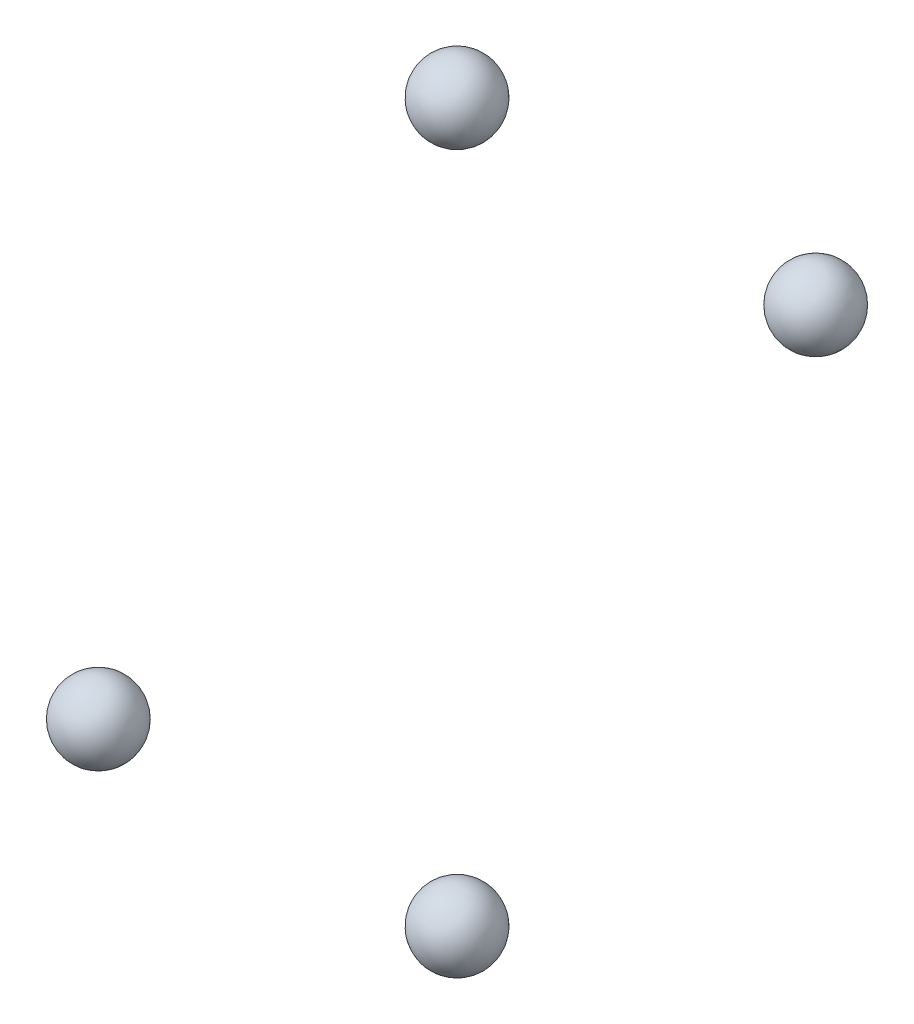
ISO-10303-21;
HEADER;
FILE_DESCRIPTION(('STEP AP214'),'2;1');
FILE_NAME('part.step','',(''),(''),'','','');
FILE_SCHEMA(('AUTOMOTIVE_DESIGN { 1 0 10303 214 1 1 1 1 }'));
ENDSEC;
DATA;
#1=APPLICATION_CONTEXT('core data for automotive mechanical design processes');
#2=APPLICATION_PROTOCOL_DEFINITION('international standard','automotive_design',2000,#1);
#3=PRODUCT_CONTEXT('',#1,'mechanical');
#4=PRODUCT('Part','Part','',(#3));
#5=PRODUCT_RELATED_PRODUCT_CATEGORY('part','',(#4));
#6=PRODUCT_DEFINITION_FORMATION('','',#4);
#7=PRODUCT_DEFINITION_CONTEXT('part definition',#1,'design');
#8=PRODUCT_DEFINITION('design','',#6,#7);
#9=PRODUCT_DEFINITION_SHAPE('','',#8);
#10=(LENGTH_UNIT() NAMED_UNIT(*) SI_UNIT(.MILLI.,.METRE.));
#11=(NAMED_UNIT(*) PLANE_ANGLE_UNIT() SI_UNIT($,.RADIAN.));
#12=(NAMED_UNIT(*) SI_UNIT($,.STERADIAN.) SOLID_ANGLE_UNIT());
#13=UNCERTAINTY_MEASURE_WITH_UNIT(LENGTH_MEASURE(1.E-05),#10,'distance_accuracy_value','');
#14=(GEOMETRIC_REPRESENTATION_CONTEXT(3) GLOBAL_UNCERTAINTY_ASSIGNED_CONTEXT((#13)) GLOBAL_UNIT_ASSIGNED_CONTEXT((#10,
#11,#12)) REPRESENTATION_CONTEXT('',''));
#15=CARTESIAN_POINT('',(0.,0.,0.));
#16=DIRECTION('',(0.,0.,1.));
#17=DIRECTION('',(1.,0.,0.));
#18=AXIS2_PLACEMENT_3D('',#15,#16,#17);
#19=CARTESIAN_POINT('',(0.,-20.5,0.));
#20=DIRECTION('',(0.,0.,-1.));
#21=DIRECTION('',(1.,0.,0.));
#22=AXIS2_PLACEMENT_3D('',#19,#20,#21);
#23=SPHERICAL_SURFACE('',#22,2.1);
#24=CARTESIAN_POINT('',(0.,-20.5,-2.1));
#25=VERTEX_POINT('',#24);
#26=VERTEX_LOOP('',#25);
#27=FACE_BOUND('',#26,.T.);
#28=ADVANCED_FACE('F12',(#27),#23,.T.);
#29=CLOSED_SHELL('',(#28));
#30=MANIFOLD_SOLID_BREP('B1',#29);
#31=CARTESIAN_POINT('',(0.,20.5,0.));
#32=DIRECTION('',(0.,0.,1.));
#33=DIRECTION('',(1.,0.,0.));
#34=AXIS2_PLACEMENT_3D('',#31,#32,#33);
#35=SPHERICAL_SURFACE('',#34,2.1);
#36=CARTESIAN_POINT('',(0.,20.5,2.1));
#37=VERTEX_POINT('',#36);
#38=VERTEX_LOOP('',#37);
#39=FACE_BOUND('',#38,.T.);
#40=ADVANCED_FACE('F20',(#39),#35,.T.);
#41=CLOSED_SHELL('',(#40));
#42=MANIFOLD_SOLID_BREP('B1',#41);
#43=CARTESIAN_POINT('',(0.,0.,0.));
#44=DIRECTION('',(0.,0.,1.));
#45=DIRECTION('',(1.,0.,0.));
#46=AXIS2_PLACEMENT_3D('',#43,#44,#45);
#47=SPHERICAL_SURFACE('',#46,0.005);
#48=CARTESIAN_POINT('',(0.,0.,0.005));
#49=VERTEX_POINT('',#48);
#50=VERTEX_LOOP('',#49);
#51=FACE_BOUND('',#50,.T.);
#52=ADVANCED_FACE('F30',(#51),#47,.T.);
#53=CLOSED_SHELL('',(#52));
#54=MANIFOLD_SOLID_BREP('B1',#53);
#55=CARTESIAN_POINT('',(0.,0.,20.5));
#56=DIRECTION('',(0.,-1.,0.));
#57=DIRECTION('',(1.,0.,0.));
#58=AXIS2_PLACEMENT_3D('',#55,#56,#57);
#59=SPHERICAL_SURFACE('',#58,2.1);
#60=CARTESIAN_POINT('',(0.,-2.1,20.5));
#61=VERTEX_POINT('',#60);
#62=VERTEX_LOOP('',#61);
#63=FACE_BOUND('',#62,.T.);
#64=ADVANCED_FACE('F33',(#63),#59,.T.);
#65=CLOSED_SHELL('',(#64));
#66=MANIFOLD_SOLID_BREP('B1',#65);
#67=CARTESIAN_POINT('',(0.,0.,-20.5));
#68=DIRECTION('',(0.,1.,0.));
#69=DIRECTION('',(1.,0.,0.));
#70=AXIS2_PLACEMENT_3D('',#67,#68,#69);
#71=SPHERICAL_SURFACE('',#70,2.1);
#72=CARTESIAN_POINT('',(0.,2.1,-20.5));
#73=VERTEX_POINT('',#72);
#74=VERTEX_LOOP('',#73);
#75=FACE_BOUND('',#74,.T.);
#76=ADVANCED_FACE('F14',(#75),#71,.T.);
#77=CLOSED_SHELL('',(#76));
#78=MANIFOLD_SOLID_BREP('B1',#77);
#79=ADVANCED_BREP_SHAPE_REPRESENTATION('',(#18,#30,#42,#54,#66,#78),#14);
#80=SHAPE_DEFINITION_REPRESENTATION(#9,#79);
ENDSEC;
END-ISO-10303-21;
